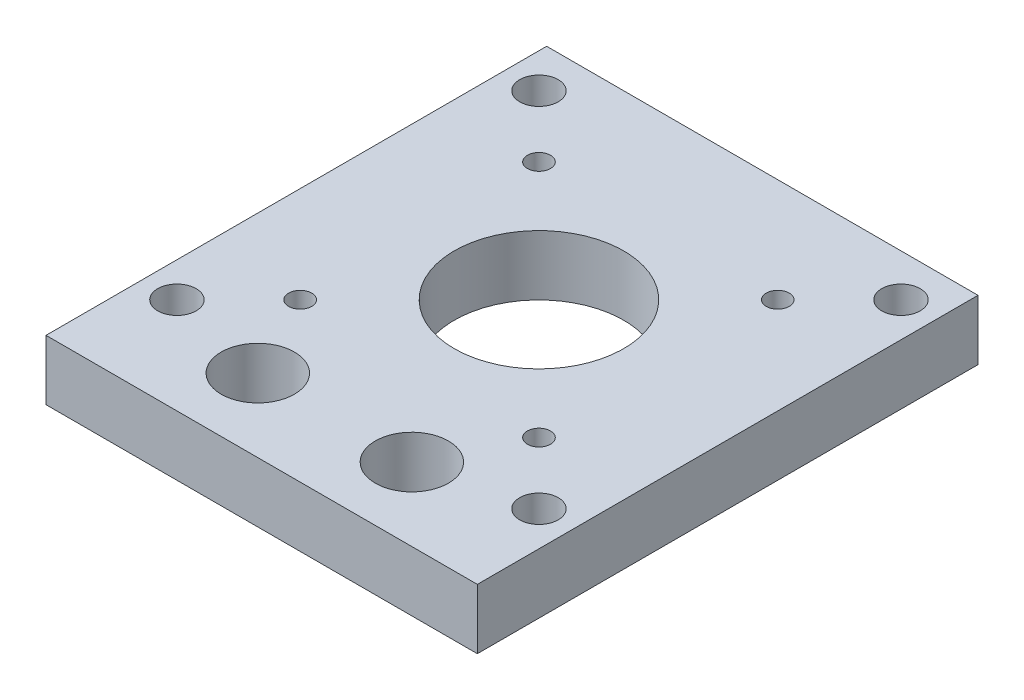
ISO-10303-21;
HEADER;
FILE_DESCRIPTION(('STEP AP214'),'2;1');
FILE_NAME('part.step','',(''),(''),'','','');
FILE_SCHEMA(('AUTOMOTIVE_DESIGN { 1 0 10303 214 1 1 1 1 }'));
ENDSEC;
DATA;
#1=APPLICATION_CONTEXT('core data for automotive mechanical design processes');
#2=APPLICATION_PROTOCOL_DEFINITION('international standard','automotive_design',2000,#1);
#3=PRODUCT_CONTEXT('',#1,'mechanical');
#4=PRODUCT('Part','Part','',(#3));
#5=PRODUCT_RELATED_PRODUCT_CATEGORY('part','',(#4));
#6=PRODUCT_DEFINITION_FORMATION('','',#4);
#7=PRODUCT_DEFINITION_CONTEXT('part definition',#1,'design');
#8=PRODUCT_DEFINITION('design','',#6,#7);
#9=PRODUCT_DEFINITION_SHAPE('','',#8);
#10=(LENGTH_UNIT() NAMED_UNIT(*) SI_UNIT(.MILLI.,.METRE.));
#11=(NAMED_UNIT(*) PLANE_ANGLE_UNIT() SI_UNIT($,.RADIAN.));
#12=(NAMED_UNIT(*) SI_UNIT($,.STERADIAN.) SOLID_ANGLE_UNIT());
#13=UNCERTAINTY_MEASURE_WITH_UNIT(LENGTH_MEASURE(1.E-05),#10,'distance_accuracy_value','');
#14=(GEOMETRIC_REPRESENTATION_CONTEXT(3) GLOBAL_UNCERTAINTY_ASSIGNED_CONTEXT((#13)) GLOBAL_UNIT_ASSIGNED_CONTEXT((#10,
#11,#12)) REPRESENTATION_CONTEXT('',''));
#15=CARTESIAN_POINT('',(0.,0.,0.));
#16=DIRECTION('',(0.,0.,1.));
#17=DIRECTION('',(1.,0.,0.));
#18=AXIS2_PLACEMENT_3D('',#15,#16,#17);
#19=CARTESIAN_POINT('',(28.,7.8,-32.5));
#20=DIRECTION('',(-1.,0.,0.));
#21=DIRECTION('',(0.,0.,1.));
#22=AXIS2_PLACEMENT_3D('',#19,#20,#21);
#23=PLANE('',#22);
#24=DIRECTION('',(0.,0.,-1.));
#25=VECTOR('',#24,1.);
#26=CARTESIAN_POINT('',(28.,0.,-32.5));
#27=LINE('',#26,#25);
#28=CARTESIAN_POINT('',(28.,0.,32.5));
#29=VERTEX_POINT('',#28);
#30=CARTESIAN_POINT('',(28.,0.,-32.5));
#31=VERTEX_POINT('',#30);
#32=EDGE_CURVE('E107',#29,#31,#27,.T.);
#33=ORIENTED_EDGE('',*,*,#32,.T.);
#34=DIRECTION('',(0.,-1.,0.));
#35=VECTOR('',#34,1.);
#36=CARTESIAN_POINT('',(28.,7.8,-32.5));
#37=LINE('',#36,#35);
#38=CARTESIAN_POINT('',(28.,7.8,-32.5));
#39=VERTEX_POINT('',#38);
#40=EDGE_CURVE('E11',#39,#31,#37,.T.);
#41=ORIENTED_EDGE('',*,*,#40,.F.);
#42=DIRECTION('',(0.,0.,-1.));
#43=VECTOR('',#42,1.);
#44=CARTESIAN_POINT('',(28.,7.8,-32.5));
#45=LINE('',#44,#43);
#46=CARTESIAN_POINT('',(28.,7.8,32.5));
#47=VERTEX_POINT('',#46);
#48=EDGE_CURVE('E91',#47,#39,#45,.T.);
#49=ORIENTED_EDGE('',*,*,#48,.F.);
#50=DIRECTION('',(0.,-1.,0.));
#51=VECTOR('',#50,1.);
#52=CARTESIAN_POINT('',(28.,7.8,32.5));
#53=LINE('',#52,#51);
#54=EDGE_CURVE('E103',#47,#29,#53,.T.);
#55=ORIENTED_EDGE('',*,*,#54,.T.);
#56=EDGE_LOOP('',(#33,#41,#49,#55));
#57=FACE_BOUND('',#56,.T.);
#58=ADVANCED_FACE('F39',(#57),#23,.F.);
#59=CARTESIAN_POINT('',(-28.,7.8,-32.5));
#60=DIRECTION('',(0.,0.,1.));
#61=DIRECTION('',(1.,0.,0.));
#62=AXIS2_PLACEMENT_3D('',#59,#60,#61);
#63=PLANE('',#62);
#64=DIRECTION('',(-1.,0.,0.));
#65=VECTOR('',#64,1.);
#66=CARTESIAN_POINT('',(-28.,0.,-32.5));
#67=LINE('',#66,#65);
#68=CARTESIAN_POINT('',(-28.,0.,-32.5));
#69=VERTEX_POINT('',#68);
#70=EDGE_CURVE('E96',#31,#69,#67,.T.);
#71=ORIENTED_EDGE('',*,*,#70,.T.);
#72=DIRECTION('',(0.,-1.,0.));
#73=VECTOR('',#72,1.);
#74=CARTESIAN_POINT('',(-28.,7.8,-32.5));
#75=LINE('',#74,#73);
#76=CARTESIAN_POINT('',(-28.,7.8,-32.5));
#77=VERTEX_POINT('',#76);
#78=EDGE_CURVE('E48',#77,#69,#75,.T.);
#79=ORIENTED_EDGE('',*,*,#78,.F.);
#80=DIRECTION('',(-1.,0.,0.));
#81=VECTOR('',#80,1.);
#82=CARTESIAN_POINT('',(-28.,7.8,-32.5));
#83=LINE('',#82,#81);
#84=EDGE_CURVE('E86',#39,#77,#83,.T.);
#85=ORIENTED_EDGE('',*,*,#84,.F.);
#86=ORIENTED_EDGE('',*,*,#40,.T.);
#87=EDGE_LOOP('',(#71,#79,#85,#86));
#88=FACE_BOUND('',#87,.T.);
#89=ADVANCED_FACE('F95',(#88),#63,.F.);
#90=CARTESIAN_POINT('',(-28.,7.8,-32.5));
#91=DIRECTION('',(1.,0.,0.));
#92=DIRECTION('',(0.,0.,-1.));
#93=AXIS2_PLACEMENT_3D('',#90,#91,#92);
#94=PLANE('',#93);
#95=DIRECTION('',(0.,0.,1.));
#96=VECTOR('',#95,1.);
#97=CARTESIAN_POINT('',(-28.,0.,-32.5));
#98=LINE('',#97,#96);
#99=CARTESIAN_POINT('',(-28.,0.,32.5));
#100=VERTEX_POINT('',#99);
#101=EDGE_CURVE('E73',#69,#100,#98,.T.);
#102=ORIENTED_EDGE('',*,*,#101,.T.);
#103=DIRECTION('',(0.,-1.,0.));
#104=VECTOR('',#103,1.);
#105=CARTESIAN_POINT('',(-28.,7.8,32.5));
#106=LINE('',#105,#104);
#107=CARTESIAN_POINT('',(-28.,7.8,32.5));
#108=VERTEX_POINT('',#107);
#109=EDGE_CURVE('E98',#108,#100,#106,.T.);
#110=ORIENTED_EDGE('',*,*,#109,.F.);
#111=DIRECTION('',(0.,0.,1.));
#112=VECTOR('',#111,1.);
#113=CARTESIAN_POINT('',(-28.,7.8,-32.5));
#114=LINE('',#113,#112);
#115=EDGE_CURVE('E89',#77,#108,#114,.T.);
#116=ORIENTED_EDGE('',*,*,#115,.F.);
#117=ORIENTED_EDGE('',*,*,#78,.T.);
#118=EDGE_LOOP('',(#102,#110,#116,#117));
#119=FACE_BOUND('',#118,.T.);
#120=ADVANCED_FACE('F99',(#119),#94,.F.);
#121=CARTESIAN_POINT('',(-28.,7.8,32.5));
#122=DIRECTION('',(0.,0.,-1.));
#123=DIRECTION('',(-1.,0.,0.));
#124=AXIS2_PLACEMENT_3D('',#121,#122,#123);
#125=PLANE('',#124);
#126=DIRECTION('',(1.,0.,0.));
#127=VECTOR('',#126,1.);
#128=CARTESIAN_POINT('',(-28.,0.,32.5));
#129=LINE('',#128,#127);
#130=EDGE_CURVE('E79',#100,#29,#129,.T.);
#131=ORIENTED_EDGE('',*,*,#130,.T.);
#132=ORIENTED_EDGE('',*,*,#54,.F.);
#133=DIRECTION('',(1.,0.,0.));
#134=VECTOR('',#133,1.);
#135=CARTESIAN_POINT('',(-28.,7.8,32.5));
#136=LINE('',#135,#134);
#137=EDGE_CURVE('E56',#108,#47,#136,.T.);
#138=ORIENTED_EDGE('',*,*,#137,.F.);
#139=ORIENTED_EDGE('',*,*,#109,.T.);
#140=EDGE_LOOP('',(#131,#132,#138,#139));
#141=FACE_BOUND('',#140,.T.);
#142=ADVANCED_FACE('F121',(#141),#125,.F.);
#143=CARTESIAN_POINT('',(0.,7.8,0.));
#144=DIRECTION('',(0.,1.,0.));
#145=DIRECTION('',(0.,0.,1.));
#146=AXIS2_PLACEMENT_3D('',#143,#144,#145);
#147=PLANE('',#146);
#148=CARTESIAN_POINT('',(-15.5,7.8,-19.));
#149=DIRECTION('',(0.,1.,0.));
#150=DIRECTION('',(0.,0.,1.));
#151=AXIS2_PLACEMENT_3D('',#148,#149,#150);
#152=CIRCLE('',#151,1.5);
#153=CARTESIAN_POINT('',(-15.5,7.8,-17.5));
#154=VERTEX_POINT('',#153);
#155=EDGE_CURVE('E177',#154,#154,#152,.T.);
#156=ORIENTED_EDGE('',*,*,#155,.F.);
#157=EDGE_LOOP('',(#156));
#158=FACE_BOUND('',#157,.T.);
#159=CARTESIAN_POINT('',(15.5,7.8,-19.));
#160=DIRECTION('',(0.,1.,0.));
#161=DIRECTION('',(0.,0.,-1.));
#162=AXIS2_PLACEMENT_3D('',#159,#160,#161);
#163=CIRCLE('',#162,1.5);
#164=CARTESIAN_POINT('',(15.5,7.8,-20.5));
#165=VERTEX_POINT('',#164);
#166=EDGE_CURVE('E169',#165,#165,#163,.T.);
#167=ORIENTED_EDGE('',*,*,#166,.F.);
#168=EDGE_LOOP('',(#167));
#169=FACE_BOUND('',#168,.T.);
#170=CARTESIAN_POINT('',(15.5,7.8,12.));
#171=DIRECTION('',(0.,1.,0.));
#172=DIRECTION('',(0.,0.,1.));
#173=AXIS2_PLACEMENT_3D('',#170,#171,#172);
#174=CIRCLE('',#173,1.5);
#175=CARTESIAN_POINT('',(15.5,7.8,13.5));
#176=VERTEX_POINT('',#175);
#177=EDGE_CURVE('E161',#176,#176,#174,.T.);
#178=ORIENTED_EDGE('',*,*,#177,.F.);
#179=EDGE_LOOP('',(#178));
#180=FACE_BOUND('',#179,.T.);
#181=CARTESIAN_POINT('',(-15.5,7.8,12.));
#182=DIRECTION('',(0.,1.,0.));
#183=DIRECTION('',(0.,0.,-1.));
#184=AXIS2_PLACEMENT_3D('',#181,#182,#183);
#185=CIRCLE('',#184,1.5);
#186=CARTESIAN_POINT('',(-15.5,7.8,10.5));
#187=VERTEX_POINT('',#186);
#188=EDGE_CURVE('E152',#187,#187,#185,.T.);
#189=ORIENTED_EDGE('',*,*,#188,.F.);
#190=EDGE_LOOP('',(#189));
#191=FACE_BOUND('',#190,.T.);
#192=CARTESIAN_POINT('',(-23.5,7.8,-27.));
#193=DIRECTION('',(0.,1.,0.));
#194=DIRECTION('',(0.,0.,1.));
#195=AXIS2_PLACEMENT_3D('',#192,#193,#194);
#196=CIRCLE('',#195,2.5);
#197=CARTESIAN_POINT('',(-23.5,7.8,-24.5));
#198=VERTEX_POINT('',#197);
#199=EDGE_CURVE('E208',#198,#198,#196,.T.);
#200=ORIENTED_EDGE('',*,*,#199,.F.);
#201=EDGE_LOOP('',(#200));
#202=FACE_BOUND('',#201,.T.);
#203=CARTESIAN_POINT('',(23.5,7.8,-27.));
#204=DIRECTION('',(0.,1.,0.));
#205=DIRECTION('',(0.,0.,-1.));
#206=AXIS2_PLACEMENT_3D('',#203,#204,#205);
#207=CIRCLE('',#206,2.5);
#208=CARTESIAN_POINT('',(23.5,7.8,-29.5));
#209=VERTEX_POINT('',#208);
#210=EDGE_CURVE('E200',#209,#209,#207,.T.);
#211=ORIENTED_EDGE('',*,*,#210,.F.);
#212=EDGE_LOOP('',(#211));
#213=FACE_BOUND('',#212,.T.);
#214=CARTESIAN_POINT('',(23.5,7.8,20.));
#215=DIRECTION('',(0.,1.,0.));
#216=DIRECTION('',(0.,0.,1.));
#217=AXIS2_PLACEMENT_3D('',#214,#215,#216);
#218=CIRCLE('',#217,2.5);
#219=CARTESIAN_POINT('',(23.5,7.8,22.5));
#220=VERTEX_POINT('',#219);
#221=EDGE_CURVE('E192',#220,#220,#218,.T.);
#222=ORIENTED_EDGE('',*,*,#221,.F.);
#223=EDGE_LOOP('',(#222));
#224=FACE_BOUND('',#223,.T.);
#225=CARTESIAN_POINT('',(-23.5,7.8,20.));
#226=DIRECTION('',(0.,1.,0.));
#227=DIRECTION('',(0.,0.,-1.));
#228=AXIS2_PLACEMENT_3D('',#225,#226,#227);
#229=CIRCLE('',#228,2.5);
#230=CARTESIAN_POINT('',(-23.5,7.8,17.5));
#231=VERTEX_POINT('',#230);
#232=EDGE_CURVE('E184',#231,#231,#229,.T.);
#233=ORIENTED_EDGE('',*,*,#232,.F.);
#234=EDGE_LOOP('',(#233));
#235=FACE_BOUND('',#234,.T.);
#236=CARTESIAN_POINT('',(0.,7.8,-3.49999999999999));
#237=DIRECTION('',(0.,1.,0.));
#238=DIRECTION('',(0.,0.,1.));
#239=AXIS2_PLACEMENT_3D('',#236,#237,#238);
#240=CIRCLE('',#239,11.);
#241=CARTESIAN_POINT('',(0.,7.8,7.50000000000001));
#242=VERTEX_POINT('',#241);
#243=EDGE_CURVE('E144',#242,#242,#240,.T.);
#244=ORIENTED_EDGE('',*,*,#243,.F.);
#245=EDGE_LOOP('',(#244));
#246=FACE_BOUND('',#245,.T.);
#247=CARTESIAN_POINT('',(-10.,7.8,23.));
#248=DIRECTION('',(0.,1.,0.));
#249=DIRECTION('',(0.,0.,1.));
#250=AXIS2_PLACEMENT_3D('',#247,#248,#249);
#251=CIRCLE('',#250,4.75);
#252=CARTESIAN_POINT('',(-10.,7.8,27.75));
#253=VERTEX_POINT('',#252);
#254=EDGE_CURVE('E137',#253,#253,#251,.T.);
#255=ORIENTED_EDGE('',*,*,#254,.F.);
#256=EDGE_LOOP('',(#255));
#257=FACE_BOUND('',#256,.T.);
#258=CARTESIAN_POINT('',(10.,7.8,23.));
#259=DIRECTION('',(0.,1.,0.));
#260=DIRECTION('',(0.,0.,-1.));
#261=AXIS2_PLACEMENT_3D('',#258,#259,#260);
#262=CIRCLE('',#261,4.75);
#263=CARTESIAN_POINT('',(10.,7.8,18.25));
#264=VERTEX_POINT('',#263);
#265=EDGE_CURVE('E128',#264,#264,#262,.T.);
#266=ORIENTED_EDGE('',*,*,#265,.F.);
#267=EDGE_LOOP('',(#266));
#268=FACE_BOUND('',#267,.T.);
#269=ORIENTED_EDGE('',*,*,#48,.T.);
#270=ORIENTED_EDGE('',*,*,#84,.T.);
#271=ORIENTED_EDGE('',*,*,#115,.T.);
#272=ORIENTED_EDGE('',*,*,#137,.T.);
#273=EDGE_LOOP('',(#269,#270,#271,#272));
#274=FACE_BOUND('',#273,.T.);
#275=ADVANCED_FACE('F87',(#158,#169,#180,#191,#202,#213,#224,#235,#246,#257,#268,#274),#147,.T.);
#276=CARTESIAN_POINT('',(0.,0.,0.));
#277=DIRECTION('',(0.,1.,0.));
#278=DIRECTION('',(0.,0.,1.));
#279=AXIS2_PLACEMENT_3D('',#276,#277,#278);
#280=PLANE('',#279);
#281=CARTESIAN_POINT('',(-15.5,0.,-19.));
#282=DIRECTION('',(0.,1.,0.));
#283=DIRECTION('',(0.,0.,1.));
#284=AXIS2_PLACEMENT_3D('',#281,#282,#283);
#285=CIRCLE('',#284,1.5);
#286=CARTESIAN_POINT('',(-15.5,0.,-17.5));
#287=VERTEX_POINT('',#286);
#288=EDGE_CURVE('E148',#287,#287,#285,.T.);
#289=ORIENTED_EDGE('',*,*,#288,.T.);
#290=EDGE_LOOP('',(#289));
#291=FACE_BOUND('',#290,.T.);
#292=CARTESIAN_POINT('',(15.5,0.,-19.));
#293=DIRECTION('',(0.,1.,0.));
#294=DIRECTION('',(0.,0.,-1.));
#295=AXIS2_PLACEMENT_3D('',#292,#293,#294);
#296=CIRCLE('',#295,1.5);
#297=CARTESIAN_POINT('',(15.5,0.,-20.5));
#298=VERTEX_POINT('',#297);
#299=EDGE_CURVE('E173',#298,#298,#296,.T.);
#300=ORIENTED_EDGE('',*,*,#299,.T.);
#301=EDGE_LOOP('',(#300));
#302=FACE_BOUND('',#301,.T.);
#303=CARTESIAN_POINT('',(15.5,0.,12.));
#304=DIRECTION('',(0.,1.,0.));
#305=DIRECTION('',(0.,0.,1.));
#306=AXIS2_PLACEMENT_3D('',#303,#304,#305);
#307=CIRCLE('',#306,1.5);
#308=CARTESIAN_POINT('',(15.5,0.,13.5));
#309=VERTEX_POINT('',#308);
#310=EDGE_CURVE('E165',#309,#309,#307,.T.);
#311=ORIENTED_EDGE('',*,*,#310,.T.);
#312=EDGE_LOOP('',(#311));
#313=FACE_BOUND('',#312,.T.);
#314=CARTESIAN_POINT('',(-15.5,0.,12.));
#315=DIRECTION('',(0.,1.,0.));
#316=DIRECTION('',(0.,0.,-1.));
#317=AXIS2_PLACEMENT_3D('',#314,#315,#316);
#318=CIRCLE('',#317,1.5);
#319=CARTESIAN_POINT('',(-15.5,0.,10.5));
#320=VERTEX_POINT('',#319);
#321=EDGE_CURVE('E156',#320,#320,#318,.T.);
#322=ORIENTED_EDGE('',*,*,#321,.T.);
#323=EDGE_LOOP('',(#322));
#324=FACE_BOUND('',#323,.T.);
#325=CARTESIAN_POINT('',(-23.5,0.,-27.));
#326=DIRECTION('',(0.,1.,0.));
#327=DIRECTION('',(0.,0.,1.));
#328=AXIS2_PLACEMENT_3D('',#325,#326,#327);
#329=CIRCLE('',#328,2.5);
#330=CARTESIAN_POINT('',(-23.5,0.,-24.5));
#331=VERTEX_POINT('',#330);
#332=EDGE_CURVE('E157',#331,#331,#329,.T.);
#333=ORIENTED_EDGE('',*,*,#332,.T.);
#334=EDGE_LOOP('',(#333));
#335=FACE_BOUND('',#334,.T.);
#336=CARTESIAN_POINT('',(23.5,0.,-27.));
#337=DIRECTION('',(0.,1.,0.));
#338=DIRECTION('',(0.,0.,-1.));
#339=AXIS2_PLACEMENT_3D('',#336,#337,#338);
#340=CIRCLE('',#339,2.5);
#341=CARTESIAN_POINT('',(23.5,0.,-29.5));
#342=VERTEX_POINT('',#341);
#343=EDGE_CURVE('E204',#342,#342,#340,.T.);
#344=ORIENTED_EDGE('',*,*,#343,.T.);
#345=EDGE_LOOP('',(#344));
#346=FACE_BOUND('',#345,.T.);
#347=CARTESIAN_POINT('',(23.5,0.,20.));
#348=DIRECTION('',(0.,1.,0.));
#349=DIRECTION('',(0.,0.,1.));
#350=AXIS2_PLACEMENT_3D('',#347,#348,#349);
#351=CIRCLE('',#350,2.5);
#352=CARTESIAN_POINT('',(23.5,0.,22.5));
#353=VERTEX_POINT('',#352);
#354=EDGE_CURVE('E196',#353,#353,#351,.T.);
#355=ORIENTED_EDGE('',*,*,#354,.T.);
#356=EDGE_LOOP('',(#355));
#357=FACE_BOUND('',#356,.T.);
#358=CARTESIAN_POINT('',(-23.5,0.,20.));
#359=DIRECTION('',(0.,1.,0.));
#360=DIRECTION('',(0.,0.,-1.));
#361=AXIS2_PLACEMENT_3D('',#358,#359,#360);
#362=CIRCLE('',#361,2.5);
#363=CARTESIAN_POINT('',(-23.5,0.,17.5));
#364=VERTEX_POINT('',#363);
#365=EDGE_CURVE('E188',#364,#364,#362,.T.);
#366=ORIENTED_EDGE('',*,*,#365,.T.);
#367=EDGE_LOOP('',(#366));
#368=FACE_BOUND('',#367,.T.);
#369=CARTESIAN_POINT('',(0.,0.,-3.49999999999999));
#370=DIRECTION('',(0.,1.,0.));
#371=DIRECTION('',(0.,0.,1.));
#372=AXIS2_PLACEMENT_3D('',#369,#370,#371);
#373=CIRCLE('',#372,11.);
#374=CARTESIAN_POINT('',(0.,0.,7.50000000000001));
#375=VERTEX_POINT('',#374);
#376=EDGE_CURVE('E133',#375,#375,#373,.T.);
#377=ORIENTED_EDGE('',*,*,#376,.T.);
#378=EDGE_LOOP('',(#377));
#379=FACE_BOUND('',#378,.T.);
#380=CARTESIAN_POINT('',(-10.,0.,23.));
#381=DIRECTION('',(0.,1.,0.));
#382=DIRECTION('',(0.,0.,1.));
#383=AXIS2_PLACEMENT_3D('',#380,#381,#382);
#384=CIRCLE('',#383,4.75);
#385=CARTESIAN_POINT('',(-10.,0.,27.75));
#386=VERTEX_POINT('',#385);
#387=EDGE_CURVE('E111',#386,#386,#384,.T.);
#388=ORIENTED_EDGE('',*,*,#387,.T.);
#389=EDGE_LOOP('',(#388));
#390=FACE_BOUND('',#389,.T.);
#391=CARTESIAN_POINT('',(10.,0.,23.));
#392=DIRECTION('',(0.,1.,0.));
#393=DIRECTION('',(0.,0.,-1.));
#394=AXIS2_PLACEMENT_3D('',#391,#392,#393);
#395=CIRCLE('',#394,4.75);
#396=CARTESIAN_POINT('',(10.,0.,18.25));
#397=VERTEX_POINT('',#396);
#398=EDGE_CURVE('E132',#397,#397,#395,.T.);
#399=ORIENTED_EDGE('',*,*,#398,.T.);
#400=EDGE_LOOP('',(#399));
#401=FACE_BOUND('',#400,.T.);
#402=ORIENTED_EDGE('',*,*,#32,.F.);
#403=ORIENTED_EDGE('',*,*,#130,.F.);
#404=ORIENTED_EDGE('',*,*,#101,.F.);
#405=ORIENTED_EDGE('',*,*,#70,.F.);
#406=EDGE_LOOP('',(#402,#403,#404,#405));
#407=FACE_BOUND('',#406,.T.);
#408=ADVANCED_FACE('F124',(#291,#302,#313,#324,#335,#346,#357,#368,#379,#390,#401,#407),#280,.F.);
#409=CARTESIAN_POINT('',(10.,0.,23.));
#410=DIRECTION('',(0.,1.,0.));
#411=DIRECTION('',(0.,0.,1.));
#412=AXIS2_PLACEMENT_3D('',#409,#410,#411);
#413=CYLINDRICAL_SURFACE('',#412,4.75);
#414=ORIENTED_EDGE('',*,*,#398,.F.);
#415=EDGE_LOOP('',(#414));
#416=FACE_BOUND('',#415,.T.);
#417=ORIENTED_EDGE('',*,*,#265,.T.);
#418=EDGE_LOOP('',(#417));
#419=FACE_BOUND('',#418,.T.);
#420=ADVANCED_FACE('F242',(#416,#419),#413,.F.);
#421=CARTESIAN_POINT('',(-10.,0.,23.));
#422=DIRECTION('',(0.,1.,0.));
#423=DIRECTION('',(0.,0.,1.));
#424=AXIS2_PLACEMENT_3D('',#421,#422,#423);
#425=CYLINDRICAL_SURFACE('',#424,4.75);
#426=ORIENTED_EDGE('',*,*,#387,.F.);
#427=EDGE_LOOP('',(#426));
#428=FACE_BOUND('',#427,.T.);
#429=ORIENTED_EDGE('',*,*,#254,.T.);
#430=EDGE_LOOP('',(#429));
#431=FACE_BOUND('',#430,.T.);
#432=ADVANCED_FACE('F244',(#428,#431),#425,.F.);
#433=CARTESIAN_POINT('',(0.,0.,-3.49999999999999));
#434=DIRECTION('',(0.,1.,0.));
#435=DIRECTION('',(0.,0.,1.));
#436=AXIS2_PLACEMENT_3D('',#433,#434,#435);
#437=CYLINDRICAL_SURFACE('',#436,11.);
#438=ORIENTED_EDGE('',*,*,#376,.F.);
#439=EDGE_LOOP('',(#438));
#440=FACE_BOUND('',#439,.T.);
#441=ORIENTED_EDGE('',*,*,#243,.T.);
#442=EDGE_LOOP('',(#441));
#443=FACE_BOUND('',#442,.T.);
#444=ADVANCED_FACE('F251',(#440,#443),#437,.F.);
#445=CARTESIAN_POINT('',(-23.5,0.,20.));
#446=DIRECTION('',(0.,1.,0.));
#447=DIRECTION('',(0.,0.,1.));
#448=AXIS2_PLACEMENT_3D('',#445,#446,#447);
#449=CYLINDRICAL_SURFACE('',#448,2.5);
#450=ORIENTED_EDGE('',*,*,#365,.F.);
#451=EDGE_LOOP('',(#450));
#452=FACE_BOUND('',#451,.T.);
#453=ORIENTED_EDGE('',*,*,#232,.T.);
#454=EDGE_LOOP('',(#453));
#455=FACE_BOUND('',#454,.T.);
#456=ADVANCED_FACE('F290',(#452,#455),#449,.F.);
#457=CARTESIAN_POINT('',(23.5,0.,20.));
#458=DIRECTION('',(0.,1.,0.));
#459=DIRECTION('',(0.,0.,1.));
#460=AXIS2_PLACEMENT_3D('',#457,#458,#459);
#461=CYLINDRICAL_SURFACE('',#460,2.5);
#462=ORIENTED_EDGE('',*,*,#354,.F.);
#463=EDGE_LOOP('',(#462));
#464=FACE_BOUND('',#463,.T.);
#465=ORIENTED_EDGE('',*,*,#221,.T.);
#466=EDGE_LOOP('',(#465));
#467=FACE_BOUND('',#466,.T.);
#468=ADVANCED_FACE('F301',(#464,#467),#461,.F.);
#469=CARTESIAN_POINT('',(23.5,0.,-27.));
#470=DIRECTION('',(0.,1.,0.));
#471=DIRECTION('',(0.,0.,1.));
#472=AXIS2_PLACEMENT_3D('',#469,#470,#471);
#473=CYLINDRICAL_SURFACE('',#472,2.5);
#474=ORIENTED_EDGE('',*,*,#343,.F.);
#475=EDGE_LOOP('',(#474));
#476=FACE_BOUND('',#475,.T.);
#477=ORIENTED_EDGE('',*,*,#210,.T.);
#478=EDGE_LOOP('',(#477));
#479=FACE_BOUND('',#478,.T.);
#480=ADVANCED_FACE('F222',(#476,#479),#473,.F.);
#481=CARTESIAN_POINT('',(-23.5,0.,-27.));
#482=DIRECTION('',(0.,1.,0.));
#483=DIRECTION('',(0.,0.,1.));
#484=AXIS2_PLACEMENT_3D('',#481,#482,#483);
#485=CYLINDRICAL_SURFACE('',#484,2.5);
#486=ORIENTED_EDGE('',*,*,#332,.F.);
#487=EDGE_LOOP('',(#486));
#488=FACE_BOUND('',#487,.T.);
#489=ORIENTED_EDGE('',*,*,#199,.T.);
#490=EDGE_LOOP('',(#489));
#491=FACE_BOUND('',#490,.T.);
#492=ADVANCED_FACE('F218',(#488,#491),#485,.F.);
#493=CARTESIAN_POINT('',(-15.5,0.,12.));
#494=DIRECTION('',(0.,1.,0.));
#495=DIRECTION('',(0.,0.,1.));
#496=AXIS2_PLACEMENT_3D('',#493,#494,#495);
#497=CYLINDRICAL_SURFACE('',#496,1.5);
#498=ORIENTED_EDGE('',*,*,#321,.F.);
#499=EDGE_LOOP('',(#498));
#500=FACE_BOUND('',#499,.T.);
#501=ORIENTED_EDGE('',*,*,#188,.T.);
#502=EDGE_LOOP('',(#501));
#503=FACE_BOUND('',#502,.T.);
#504=ADVANCED_FACE('F221',(#500,#503),#497,.F.);
#505=CARTESIAN_POINT('',(15.5,0.,12.));
#506=DIRECTION('',(0.,1.,0.));
#507=DIRECTION('',(0.,0.,1.));
#508=AXIS2_PLACEMENT_3D('',#505,#506,#507);
#509=CYLINDRICAL_SURFACE('',#508,1.5);
#510=ORIENTED_EDGE('',*,*,#310,.F.);
#511=EDGE_LOOP('',(#510));
#512=FACE_BOUND('',#511,.T.);
#513=ORIENTED_EDGE('',*,*,#177,.T.);
#514=EDGE_LOOP('',(#513));
#515=FACE_BOUND('',#514,.T.);
#516=ADVANCED_FACE('F335',(#512,#515),#509,.F.);
#517=CARTESIAN_POINT('',(15.5,0.,-19.));
#518=DIRECTION('',(0.,1.,0.));
#519=DIRECTION('',(0.,0.,1.));
#520=AXIS2_PLACEMENT_3D('',#517,#518,#519);
#521=CYLINDRICAL_SURFACE('',#520,1.5);
#522=ORIENTED_EDGE('',*,*,#299,.F.);
#523=EDGE_LOOP('',(#522));
#524=FACE_BOUND('',#523,.T.);
#525=ORIENTED_EDGE('',*,*,#166,.T.);
#526=EDGE_LOOP('',(#525));
#527=FACE_BOUND('',#526,.T.);
#528=ADVANCED_FACE('F345',(#524,#527),#521,.F.);
#529=CARTESIAN_POINT('',(-15.5,0.,-19.));
#530=DIRECTION('',(0.,1.,0.));
#531=DIRECTION('',(0.,0.,1.));
#532=AXIS2_PLACEMENT_3D('',#529,#530,#531);
#533=CYLINDRICAL_SURFACE('',#532,1.5);
#534=ORIENTED_EDGE('',*,*,#288,.F.);
#535=EDGE_LOOP('',(#534));
#536=FACE_BOUND('',#535,.T.);
#537=ORIENTED_EDGE('',*,*,#155,.T.);
#538=EDGE_LOOP('',(#537));
#539=FACE_BOUND('',#538,.T.);
#540=ADVANCED_FACE('F355',(#536,#539),#533,.F.);
#541=CLOSED_SHELL('',(#58,#89,#120,#142,#275,#408,#420,#432,#444,#456,#468,#480,#492,#504,#516,
#528,#540));
#542=MANIFOLD_SOLID_BREP('B2',#541);
#543=ADVANCED_BREP_SHAPE_REPRESENTATION('',(#18,#542),#14);
#544=SHAPE_DEFINITION_REPRESENTATION(#9,#543);
ENDSEC;
END-ISO-10303-21;
